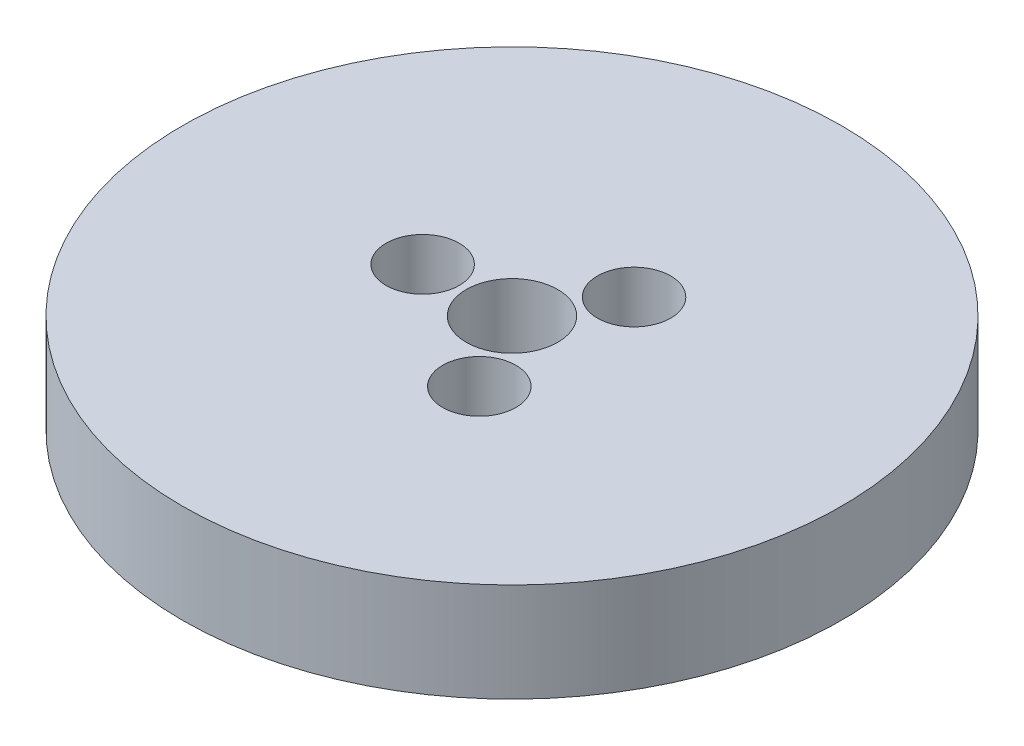
ISO-10303-21;
HEADER;
FILE_DESCRIPTION(('STEP AP214'),'2;1');
FILE_NAME('part.step','',(''),(''),'','','');
FILE_SCHEMA(('AUTOMOTIVE_DESIGN { 1 0 10303 214 1 1 1 1 }'));
ENDSEC;
DATA;
#1=APPLICATION_CONTEXT('core data for automotive mechanical design processes');
#2=APPLICATION_PROTOCOL_DEFINITION('international standard','automotive_design',2000,#1);
#3=PRODUCT_CONTEXT('',#1,'mechanical');
#4=PRODUCT('Part','Part','',(#3));
#5=PRODUCT_RELATED_PRODUCT_CATEGORY('part','',(#4));
#6=PRODUCT_DEFINITION_FORMATION('','',#4);
#7=PRODUCT_DEFINITION_CONTEXT('part definition',#1,'design');
#8=PRODUCT_DEFINITION('design','',#6,#7);
#9=PRODUCT_DEFINITION_SHAPE('','',#8);
#10=(LENGTH_UNIT() NAMED_UNIT(*) SI_UNIT(.MILLI.,.METRE.));
#11=(NAMED_UNIT(*) PLANE_ANGLE_UNIT() SI_UNIT($,.RADIAN.));
#12=(NAMED_UNIT(*) SI_UNIT($,.STERADIAN.) SOLID_ANGLE_UNIT());
#13=UNCERTAINTY_MEASURE_WITH_UNIT(LENGTH_MEASURE(1.E-05),#10,'distance_accuracy_value','');
#14=(GEOMETRIC_REPRESENTATION_CONTEXT(3) GLOBAL_UNCERTAINTY_ASSIGNED_CONTEXT((#13)) GLOBAL_UNIT_ASSIGNED_CONTEXT((#10,
#11,#12)) REPRESENTATION_CONTEXT('',''));
#15=CARTESIAN_POINT('',(0.,0.,0.));
#16=DIRECTION('',(0.,0.,1.));
#17=DIRECTION('',(1.,0.,0.));
#18=AXIS2_PLACEMENT_3D('',#15,#16,#17);
#19=CARTESIAN_POINT('',(0.,27.,0.));
#20=DIRECTION('',(0.,-1.,0.));
#21=DIRECTION('',(0.,0.,-1.));
#22=AXIS2_PLACEMENT_3D('',#19,#20,#21);
#23=CYLINDRICAL_SURFACE('',#22,90.);
#24=CARTESIAN_POINT('',(0.,27.,0.));
#25=DIRECTION('',(0.,1.,0.));
#26=DIRECTION('',(0.,0.,1.));
#27=AXIS2_PLACEMENT_3D('',#24,#25,#26);
#28=CIRCLE('',#27,90.);
#29=CARTESIAN_POINT('',(0.,27.,90.));
#30=VERTEX_POINT('',#29);
#31=EDGE_CURVE('E10',#30,#30,#28,.T.);
#32=ORIENTED_EDGE('',*,*,#31,.F.);
#33=EDGE_LOOP('',(#32));
#34=FACE_BOUND('',#33,.T.);
#35=CARTESIAN_POINT('',(0.,0.,0.));
#36=DIRECTION('',(0.,1.,0.));
#37=DIRECTION('',(0.,0.,1.));
#38=AXIS2_PLACEMENT_3D('',#35,#36,#37);
#39=CIRCLE('',#38,90.);
#40=CARTESIAN_POINT('',(0.,0.,90.));
#41=VERTEX_POINT('',#40);
#42=EDGE_CURVE('E37',#41,#41,#39,.T.);
#43=ORIENTED_EDGE('',*,*,#42,.T.);
#44=EDGE_LOOP('',(#43));
#45=FACE_BOUND('',#44,.T.);
#46=ADVANCED_FACE('F40',(#34,#45),#23,.T.);
#47=CARTESIAN_POINT('',(0.,27.,0.));
#48=DIRECTION('',(0.,1.,0.));
#49=DIRECTION('',(0.,0.,1.));
#50=AXIS2_PLACEMENT_3D('',#47,#48,#49);
#51=PLANE('',#50);
#52=CARTESIAN_POINT('',(12.2001638812998,27.,21.1313037030777));
#53=DIRECTION('',(0.,1.,0.));
#54=DIRECTION('',(0.866025403784436,0.,-0.500000000000004));
#55=AXIS2_PLACEMENT_3D('',#52,#53,#54);
#56=CIRCLE('',#55,10.);
#57=CARTESIAN_POINT('',(20.8604179191442,27.,16.1313037030777));
#58=VERTEX_POINT('',#57);
#59=EDGE_CURVE('E70',#58,#58,#56,.T.);
#60=ORIENTED_EDGE('',*,*,#59,.F.);
#61=EDGE_LOOP('',(#60));
#62=FACE_BOUND('',#61,.T.);
#63=CARTESIAN_POINT('',(12.2001638812995,27.,-21.1313037030779));
#64=DIRECTION('',(0.,1.,0.));
#65=DIRECTION('',(-0.866025403784443,0.,-0.499999999999992));
#66=AXIS2_PLACEMENT_3D('',#63,#64,#65);
#67=CIRCLE('',#66,10.);
#68=CARTESIAN_POINT('',(3.53990984345506,27.,-26.1313037030778));
#69=VERTEX_POINT('',#68);
#70=EDGE_CURVE('E61',#69,#69,#67,.T.);
#71=ORIENTED_EDGE('',*,*,#70,.F.);
#72=EDGE_LOOP('',(#71));
#73=FACE_BOUND('',#72,.T.);
#74=CARTESIAN_POINT('',(-24.4003277625994,27.,0.));
#75=DIRECTION('',(0.,1.,0.));
#76=DIRECTION('',(0.,0.,1.));
#77=AXIS2_PLACEMENT_3D('',#74,#75,#76);
#78=CIRCLE('',#77,10.);
#79=CARTESIAN_POINT('',(-24.4003277625994,27.,10.));
#80=VERTEX_POINT('',#79);
#81=EDGE_CURVE('E54',#80,#80,#78,.T.);
#82=ORIENTED_EDGE('',*,*,#81,.F.);
#83=EDGE_LOOP('',(#82));
#84=FACE_BOUND('',#83,.T.);
#85=CARTESIAN_POINT('',(0.,27.,0.));
#86=DIRECTION('',(0.,1.,0.));
#87=DIRECTION('',(0.,0.,1.));
#88=AXIS2_PLACEMENT_3D('',#85,#86,#87);
#89=CIRCLE('',#88,12.5);
#90=CARTESIAN_POINT('',(0.,27.,12.5));
#91=VERTEX_POINT('',#90);
#92=EDGE_CURVE('E50',#91,#91,#89,.T.);
#93=ORIENTED_EDGE('',*,*,#92,.F.);
#94=EDGE_LOOP('',(#93));
#95=FACE_BOUND('',#94,.T.);
#96=ORIENTED_EDGE('',*,*,#31,.T.);
#97=EDGE_LOOP('',(#96));
#98=FACE_BOUND('',#97,.T.);
#99=ADVANCED_FACE('F85',(#62,#73,#84,#95,#98),#51,.T.);
#100=CARTESIAN_POINT('',(0.,0.,0.));
#101=DIRECTION('',(0.,1.,0.));
#102=DIRECTION('',(0.,0.,1.));
#103=AXIS2_PLACEMENT_3D('',#100,#101,#102);
#104=PLANE('',#103);
#105=CARTESIAN_POINT('',(0.,0.,0.));
#106=DIRECTION('',(0.,1.,0.));
#107=DIRECTION('',(0.,0.,1.));
#108=AXIS2_PLACEMENT_3D('',#105,#106,#107);
#109=CIRCLE('',#108,12.5);
#110=CARTESIAN_POINT('',(0.,0.,12.5));
#111=VERTEX_POINT('',#110);
#112=EDGE_CURVE('E47',#111,#111,#109,.T.);
#113=ORIENTED_EDGE('',*,*,#112,.T.);
#114=EDGE_LOOP('',(#113));
#115=FACE_BOUND('',#114,.T.);
#116=ORIENTED_EDGE('',*,*,#42,.F.);
#117=EDGE_LOOP('',(#116));
#118=FACE_BOUND('',#117,.T.);
#119=ADVANCED_FACE('F84',(#115,#118),#104,.F.);
#120=CARTESIAN_POINT('',(0.,27.,0.));
#121=DIRECTION('',(0.,-1.,0.));
#122=DIRECTION('',(0.,0.,-1.));
#123=AXIS2_PLACEMENT_3D('',#120,#121,#122);
#124=CYLINDRICAL_SURFACE('',#123,12.5);
#125=ORIENTED_EDGE('',*,*,#92,.T.);
#126=EDGE_LOOP('',(#125));
#127=FACE_BOUND('',#126,.T.);
#128=ORIENTED_EDGE('',*,*,#112,.F.);
#129=EDGE_LOOP('',(#128));
#130=FACE_BOUND('',#129,.T.);
#131=ADVANCED_FACE('F91',(#127,#130),#124,.F.);
#132=CARTESIAN_POINT('',(-24.4003277625994,2.26176164910926,0.));
#133=DIRECTION('',(0.,1.,0.));
#134=DIRECTION('',(0.,0.,1.));
#135=AXIS2_PLACEMENT_3D('',#132,#133,#134);
#136=CYLINDRICAL_SURFACE('',#135,10.);
#137=CARTESIAN_POINT('',(-24.4003277625994,2.26176164910926,0.));
#138=DIRECTION('',(0.,1.,0.));
#139=DIRECTION('',(0.,0.,1.));
#140=AXIS2_PLACEMENT_3D('',#137,#138,#139);
#141=CIRCLE('',#140,10.);
#142=CARTESIAN_POINT('',(-24.4003277625994,2.26176164910926,10.));
#143=VERTEX_POINT('',#142);
#144=EDGE_CURVE('E55',#143,#143,#141,.T.);
#145=ORIENTED_EDGE('',*,*,#144,.F.);
#146=EDGE_LOOP('',(#145));
#147=FACE_BOUND('',#146,.T.);
#148=ORIENTED_EDGE('',*,*,#81,.T.);
#149=EDGE_LOOP('',(#148));
#150=FACE_BOUND('',#149,.T.);
#151=ADVANCED_FACE('F96',(#147,#150),#136,.F.);
#152=CARTESIAN_POINT('',(-24.4003277625994,2.26176164910926,0.));
#153=DIRECTION('',(0.,1.,0.));
#154=DIRECTION('',(0.,0.,1.));
#155=AXIS2_PLACEMENT_3D('',#152,#153,#154);
#156=PLANE('',#155);
#157=ORIENTED_EDGE('',*,*,#144,.T.);
#158=EDGE_LOOP('',(#157));
#159=FACE_BOUND('',#158,.T.);
#160=ADVANCED_FACE('F127',(#159),#156,.T.);
#161=CARTESIAN_POINT('',(12.2001638812995,2.26176164910926,-21.1313037030779));
#162=DIRECTION('',(0.,1.,0.));
#163=DIRECTION('',(0.,0.,1.));
#164=AXIS2_PLACEMENT_3D('',#161,#162,#163);
#165=CYLINDRICAL_SURFACE('',#164,10.);
#166=CARTESIAN_POINT('',(12.2001638812995,2.26176164910926,-21.1313037030779));
#167=DIRECTION('',(0.,1.,0.));
#168=DIRECTION('',(-0.866025403784443,0.,-0.499999999999992));
#169=AXIS2_PLACEMENT_3D('',#166,#167,#168);
#170=CIRCLE('',#169,10.);
#171=CARTESIAN_POINT('',(3.53990984345506,2.26176164910926,-26.1313037030778));
#172=VERTEX_POINT('',#171);
#173=EDGE_CURVE('E63',#172,#172,#170,.T.);
#174=ORIENTED_EDGE('',*,*,#173,.F.);
#175=EDGE_LOOP('',(#174));
#176=FACE_BOUND('',#175,.T.);
#177=ORIENTED_EDGE('',*,*,#70,.T.);
#178=EDGE_LOOP('',(#177));
#179=FACE_BOUND('',#178,.T.);
#180=ADVANCED_FACE('F133',(#176,#179),#165,.F.);
#181=CARTESIAN_POINT('',(12.2001638812995,2.26176164910926,-21.1313037030779));
#182=DIRECTION('',(0.,1.,0.));
#183=DIRECTION('',(-0.866025403784443,0.,-0.499999999999992));
#184=AXIS2_PLACEMENT_3D('',#181,#182,#183);
#185=PLANE('',#184);
#186=ORIENTED_EDGE('',*,*,#173,.T.);
#187=EDGE_LOOP('',(#186));
#188=FACE_BOUND('',#187,.T.);
#189=ADVANCED_FACE('F77',(#188),#185,.T.);
#190=CARTESIAN_POINT('',(12.2001638812998,2.26176164910926,21.1313037030777));
#191=DIRECTION('',(0.,1.,0.));
#192=DIRECTION('',(0.,0.,1.));
#193=AXIS2_PLACEMENT_3D('',#190,#191,#192);
#194=CYLINDRICAL_SURFACE('',#193,10.);
#195=CARTESIAN_POINT('',(12.2001638812998,2.26176164910926,21.1313037030777));
#196=DIRECTION('',(0.,1.,0.));
#197=DIRECTION('',(0.866025403784436,0.,-0.500000000000004));
#198=AXIS2_PLACEMENT_3D('',#195,#196,#197);
#199=CIRCLE('',#198,10.);
#200=CARTESIAN_POINT('',(20.8604179191442,2.26176164910926,16.1313037030777));
#201=VERTEX_POINT('',#200);
#202=EDGE_CURVE('E59',#201,#201,#199,.T.);
#203=ORIENTED_EDGE('',*,*,#202,.F.);
#204=EDGE_LOOP('',(#203));
#205=FACE_BOUND('',#204,.T.);
#206=ORIENTED_EDGE('',*,*,#59,.T.);
#207=EDGE_LOOP('',(#206));
#208=FACE_BOUND('',#207,.T.);
#209=ADVANCED_FACE('F73',(#205,#208),#194,.F.);
#210=CARTESIAN_POINT('',(12.2001638812998,2.26176164910926,21.1313037030777));
#211=DIRECTION('',(0.,1.,0.));
#212=DIRECTION('',(0.866025403784436,0.,-0.500000000000004));
#213=AXIS2_PLACEMENT_3D('',#210,#211,#212);
#214=PLANE('',#213);
#215=ORIENTED_EDGE('',*,*,#202,.T.);
#216=EDGE_LOOP('',(#215));
#217=FACE_BOUND('',#216,.T.);
#218=ADVANCED_FACE('F71',(#217),#214,.T.);
#219=CLOSED_SHELL('',(#46,#99,#119,#131,#151,#160,#180,#189,#209,#218));
#220=MANIFOLD_SOLID_BREP('B2',#219);
#221=ADVANCED_BREP_SHAPE_REPRESENTATION('',(#18,#220),#14);
#222=SHAPE_DEFINITION_REPRESENTATION(#9,#221);
ENDSEC;
END-ISO-10303-21;
